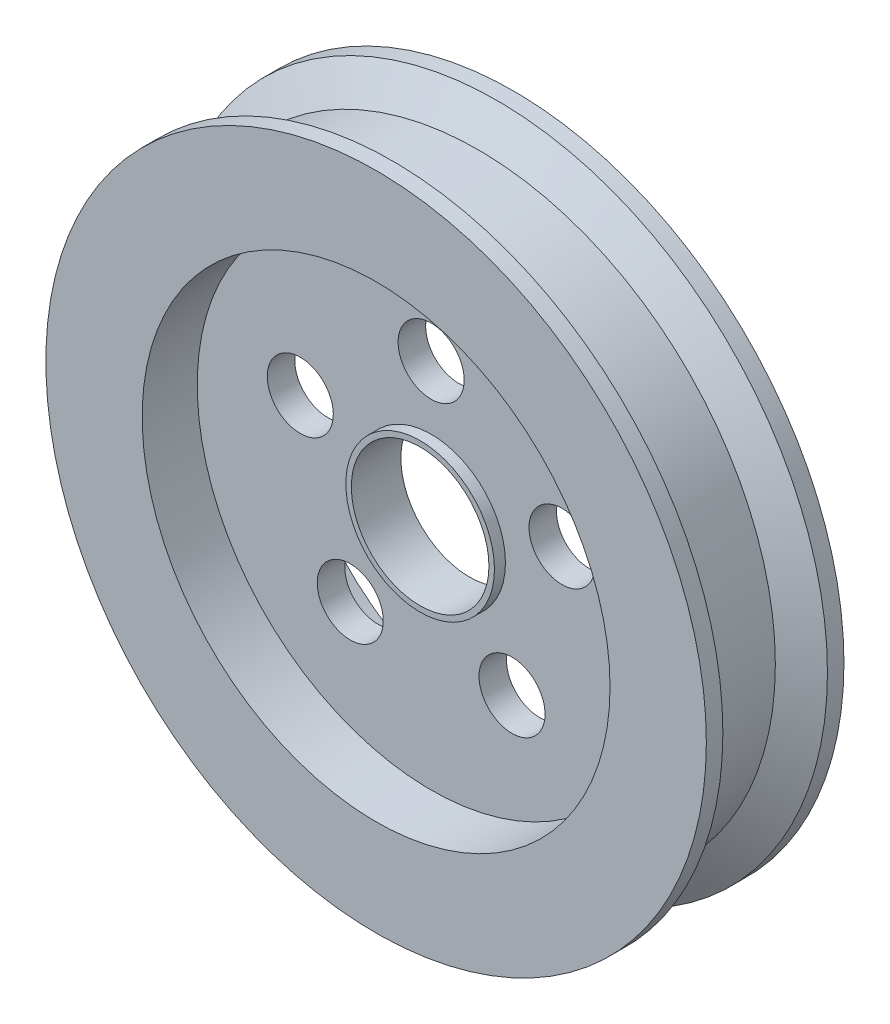
ISO-10303-21;
HEADER;
FILE_DESCRIPTION(('STEP AP214'),'2;1');
FILE_NAME('part.step','',(''),(''),'','','');
FILE_SCHEMA(('AUTOMOTIVE_DESIGN { 1 0 10303 214 1 1 1 1 }'));
ENDSEC;
DATA;
#1=APPLICATION_CONTEXT('core data for automotive mechanical design processes');
#2=APPLICATION_PROTOCOL_DEFINITION('international standard','automotive_design',2000,#1);
#3=PRODUCT_CONTEXT('',#1,'mechanical');
#4=PRODUCT('Part','Part','',(#3));
#5=PRODUCT_RELATED_PRODUCT_CATEGORY('part','',(#4));
#6=PRODUCT_DEFINITION_FORMATION('','',#4);
#7=PRODUCT_DEFINITION_CONTEXT('part definition',#1,'design');
#8=PRODUCT_DEFINITION('design','',#6,#7);
#9=PRODUCT_DEFINITION_SHAPE('','',#8);
#10=(LENGTH_UNIT() NAMED_UNIT(*) SI_UNIT(.MILLI.,.METRE.));
#11=(NAMED_UNIT(*) PLANE_ANGLE_UNIT() SI_UNIT($,.RADIAN.));
#12=(NAMED_UNIT(*) SI_UNIT($,.STERADIAN.) SOLID_ANGLE_UNIT());
#13=UNCERTAINTY_MEASURE_WITH_UNIT(LENGTH_MEASURE(1.E-05),#10,'distance_accuracy_value','');
#14=(GEOMETRIC_REPRESENTATION_CONTEXT(3) GLOBAL_UNCERTAINTY_ASSIGNED_CONTEXT((#13)) GLOBAL_UNIT_ASSIGNED_CONTEXT((#10,
#11,#12)) REPRESENTATION_CONTEXT('',''));
#15=CARTESIAN_POINT('',(0.,0.,0.));
#16=DIRECTION('',(0.,0.,1.));
#17=DIRECTION('',(1.,0.,0.));
#18=AXIS2_PLACEMENT_3D('',#15,#16,#17);
#19=CARTESIAN_POINT('',(0.,0.,12.5));
#20=DIRECTION('',(0.,0.,-1.));
#21=DIRECTION('',(-1.,0.,0.));
#22=AXIS2_PLACEMENT_3D('',#19,#20,#21);
#23=CYLINDRICAL_SURFACE('',#22,60.);
#24=CARTESIAN_POINT('',(0.,0.,-9.5));
#25=DIRECTION('',(0.,0.,1.));
#26=DIRECTION('',(1.,0.,0.));
#27=AXIS2_PLACEMENT_3D('',#24,#25,#26);
#28=CIRCLE('',#27,60.);
#29=CARTESIAN_POINT('',(60.,0.,-9.5));
#30=VERTEX_POINT('',#29);
#31=EDGE_CURVE('E57',#30,#30,#28,.T.);
#32=ORIENTED_EDGE('',*,*,#31,.F.);
#33=EDGE_LOOP('',(#32));
#34=FACE_BOUND('',#33,.T.);
#35=CARTESIAN_POINT('',(0.,0.,-12.5));
#36=DIRECTION('',(0.,0.,1.));
#37=DIRECTION('',(1.,0.,0.));
#38=AXIS2_PLACEMENT_3D('',#35,#36,#37);
#39=CIRCLE('',#38,60.);
#40=CARTESIAN_POINT('',(60.,0.,-12.5));
#41=VERTEX_POINT('',#40);
#42=EDGE_CURVE('E88',#41,#41,#39,.T.);
#43=ORIENTED_EDGE('',*,*,#42,.T.);
#44=EDGE_LOOP('',(#43));
#45=FACE_BOUND('',#44,.T.);
#46=ADVANCED_FACE('F31',(#34,#45),#23,.T.);
#47=CARTESIAN_POINT('',(0.,0.,12.5));
#48=DIRECTION('',(0.,0.,1.));
#49=DIRECTION('',(1.,0.,0.));
#50=AXIS2_PLACEMENT_3D('',#47,#48,#49);
#51=PLANE('',#50);
#52=CARTESIAN_POINT('',(0.,0.,12.5));
#53=DIRECTION('',(0.,0.,1.));
#54=DIRECTION('',(1.,0.,0.));
#55=AXIS2_PLACEMENT_3D('',#52,#53,#54);
#56=CIRCLE('',#55,42.5);
#57=CARTESIAN_POINT('',(42.5,0.,12.5));
#58=VERTEX_POINT('',#57);
#59=EDGE_CURVE('E81',#58,#58,#56,.T.);
#60=ORIENTED_EDGE('',*,*,#59,.F.);
#61=EDGE_LOOP('',(#60));
#62=FACE_BOUND('',#61,.T.);
#63=CARTESIAN_POINT('',(0.,0.,12.5));
#64=DIRECTION('',(0.,0.,1.));
#65=DIRECTION('',(1.,0.,0.));
#66=AXIS2_PLACEMENT_3D('',#63,#64,#65);
#67=CIRCLE('',#66,60.);
#68=CARTESIAN_POINT('',(60.,0.,12.5));
#69=VERTEX_POINT('',#68);
#70=EDGE_CURVE('E43',#69,#69,#67,.T.);
#71=ORIENTED_EDGE('',*,*,#70,.T.);
#72=EDGE_LOOP('',(#71));
#73=FACE_BOUND('',#72,.T.);
#74=ADVANCED_FACE('F136',(#62,#73),#51,.T.);
#75=CARTESIAN_POINT('',(0.,0.,-12.5));
#76=DIRECTION('',(0.,0.,1.));
#77=DIRECTION('',(1.,0.,0.));
#78=AXIS2_PLACEMENT_3D('',#75,#76,#77);
#79=PLANE('',#78);
#80=CARTESIAN_POINT('',(0.,0.,-12.5));
#81=DIRECTION('',(0.,0.,1.));
#82=DIRECTION('',(1.,0.,0.));
#83=AXIS2_PLACEMENT_3D('',#80,#81,#82);
#84=CIRCLE('',#83,42.5);
#85=CARTESIAN_POINT('',(42.5,0.,-12.5));
#86=VERTEX_POINT('',#85);
#87=EDGE_CURVE('E82',#86,#86,#84,.T.);
#88=ORIENTED_EDGE('',*,*,#87,.T.);
#89=EDGE_LOOP('',(#88));
#90=FACE_BOUND('',#89,.T.);
#91=ORIENTED_EDGE('',*,*,#42,.F.);
#92=EDGE_LOOP('',(#91));
#93=FACE_BOUND('',#92,.T.);
#94=ADVANCED_FACE('F133',(#90,#93),#79,.F.);
#95=CARTESIAN_POINT('',(0.,0.,9.5));
#96=DIRECTION('',(0.,0.,1.));
#97=DIRECTION('',(1.,0.,0.));
#98=AXIS2_PLACEMENT_3D('',#95,#96,#97);
#99=CIRCLE('',#98,60.);
#100=CARTESIAN_POINT('',(60.,0.,9.5));
#101=VERTEX_POINT('',#100);
#102=EDGE_CURVE('E48',#101,#101,#99,.T.);
#103=ORIENTED_EDGE('',*,*,#102,.T.);
#104=EDGE_LOOP('',(#103));
#105=FACE_BOUND('',#104,.T.);
#106=ORIENTED_EDGE('',*,*,#70,.F.);
#107=EDGE_LOOP('',(#106));
#108=FACE_BOUND('',#107,.T.);
#109=ADVANCED_FACE('F33',(#105,#108),#23,.T.);
#110=CARTESIAN_POINT('',(0.,0.,2.5));
#111=DIRECTION('',(0.,0.,1.));
#112=DIRECTION('',(1.,0.,0.));
#113=AXIS2_PLACEMENT_3D('',#110,#111,#112);
#114=CYLINDRICAL_SURFACE('',#113,42.5);
#115=CARTESIAN_POINT('',(0.,0.,2.5));
#116=DIRECTION('',(0.,0.,1.));
#117=DIRECTION('',(1.,0.,0.));
#118=AXIS2_PLACEMENT_3D('',#115,#116,#117);
#119=CIRCLE('',#118,42.5);
#120=CARTESIAN_POINT('',(42.5,0.,2.5));
#121=VERTEX_POINT('',#120);
#122=EDGE_CURVE('E85',#121,#121,#119,.T.);
#123=ORIENTED_EDGE('',*,*,#122,.F.);
#124=EDGE_LOOP('',(#123));
#125=FACE_BOUND('',#124,.T.);
#126=ORIENTED_EDGE('',*,*,#59,.T.);
#127=EDGE_LOOP('',(#126));
#128=FACE_BOUND('',#127,.T.);
#129=ADVANCED_FACE('F148',(#125,#128),#114,.F.);
#130=CARTESIAN_POINT('',(0.,0.,2.5));
#131=DIRECTION('',(0.,0.,1.));
#132=DIRECTION('',(1.,0.,0.));
#133=AXIS2_PLACEMENT_3D('',#130,#131,#132);
#134=PLANE('',#133);
#135=CARTESIAN_POINT('',(0.,0.,2.5));
#136=DIRECTION('',(0.,0.,1.));
#137=DIRECTION('',(1.,0.,0.));
#138=AXIS2_PLACEMENT_3D('',#135,#136,#137);
#139=CIRCLE('',#138,13.5);
#140=CARTESIAN_POINT('',(13.5,0.,2.5));
#141=VERTEX_POINT('',#140);
#142=EDGE_CURVE('E10',#141,#141,#139,.T.);
#143=ORIENTED_EDGE('',*,*,#142,.F.);
#144=EDGE_LOOP('',(#143));
#145=FACE_BOUND('',#144,.T.);
#146=CARTESIAN_POINT('',(-23.7764129073788,7.72542485937396,2.5));
#147=DIRECTION('',(0.,0.,1.));
#148=DIRECTION('',(0.309016994374958,0.95105651629515,0.));
#149=AXIS2_PLACEMENT_3D('',#146,#147,#148);
#150=CIRCLE('',#149,6.);
#151=CARTESIAN_POINT('',(-21.922310941129,13.4317639571449,2.5));
#152=VERTEX_POINT('',#151);
#153=EDGE_CURVE('E60',#152,#152,#150,.T.);
#154=ORIENTED_EDGE('',*,*,#153,.F.);
#155=EDGE_LOOP('',(#154));
#156=FACE_BOUND('',#155,.T.);
#157=CARTESIAN_POINT('',(-14.694631307312,-20.2254248593736,2.5));
#158=DIRECTION('',(0.,0.,1.));
#159=DIRECTION('',(-0.809016994374942,0.58778525229248,0.));
#160=AXIS2_PLACEMENT_3D('',#157,#158,#159);
#161=CIRCLE('',#160,6.);
#162=CARTESIAN_POINT('',(-19.5487332735617,-16.6987133456187,2.5));
#163=VERTEX_POINT('',#162);
#164=EDGE_CURVE('E65',#163,#163,#161,.T.);
#165=ORIENTED_EDGE('',*,*,#164,.F.);
#166=EDGE_LOOP('',(#165));
#167=FACE_BOUND('',#166,.T.);
#168=CARTESIAN_POINT('',(14.6946313073117,-20.2254248593738,2.5));
#169=DIRECTION('',(0.,0.,1.));
#170=DIRECTION('',(-0.809016994374951,-0.587785252292469,0.));
#171=AXIS2_PLACEMENT_3D('',#168,#169,#170);
#172=CIRCLE('',#171,6.);
#173=CARTESIAN_POINT('',(9.84052934106201,-23.7521363731286,2.5));
#174=VERTEX_POINT('',#173);
#175=EDGE_CURVE('E61',#174,#174,#172,.T.);
#176=ORIENTED_EDGE('',*,*,#175,.F.);
#177=EDGE_LOOP('',(#176));
#178=FACE_BOUND('',#177,.T.);
#179=CARTESIAN_POINT('',(23.7764129073789,7.72542485937362,2.5));
#180=DIRECTION('',(0.,0.,1.));
#181=DIRECTION('',(0.309016994374945,-0.951056516295155,0.));
#182=AXIS2_PLACEMENT_3D('',#179,#180,#181);
#183=CIRCLE('',#182,6.);
#184=CARTESIAN_POINT('',(25.6305148736285,2.01908576160269,2.5));
#185=VERTEX_POINT('',#184);
#186=EDGE_CURVE('E64',#185,#185,#183,.T.);
#187=ORIENTED_EDGE('',*,*,#186,.F.);
#188=EDGE_LOOP('',(#187));
#189=FACE_BOUND('',#188,.T.);
#190=CARTESIAN_POINT('',(0.,25.,2.5));
#191=DIRECTION('',(0.,0.,1.));
#192=DIRECTION('',(1.,0.,0.));
#193=AXIS2_PLACEMENT_3D('',#190,#191,#192);
#194=CIRCLE('',#193,6.);
#195=CARTESIAN_POINT('',(6.,25.,2.5));
#196=VERTEX_POINT('',#195);
#197=EDGE_CURVE('E73',#196,#196,#194,.T.);
#198=ORIENTED_EDGE('',*,*,#197,.F.);
#199=EDGE_LOOP('',(#198));
#200=FACE_BOUND('',#199,.T.);
#201=ORIENTED_EDGE('',*,*,#122,.T.);
#202=EDGE_LOOP('',(#201));
#203=FACE_BOUND('',#202,.T.);
#204=ADVANCED_FACE('F129',(#145,#156,#167,#178,#189,#200,#203),#134,.T.);
#205=CARTESIAN_POINT('',(0.,0.,-2.5));
#206=DIRECTION('',(0.,0.,-1.));
#207=DIRECTION('',(-1.,0.,0.));
#208=AXIS2_PLACEMENT_3D('',#205,#206,#207);
#209=CYLINDRICAL_SURFACE('',#208,42.5);
#210=CARTESIAN_POINT('',(0.,0.,-2.5));
#211=DIRECTION('',(0.,0.,1.));
#212=DIRECTION('',(1.,0.,0.));
#213=AXIS2_PLACEMENT_3D('',#210,#211,#212);
#214=CIRCLE('',#213,42.5);
#215=CARTESIAN_POINT('',(42.5,0.,-2.5));
#216=VERTEX_POINT('',#215);
#217=EDGE_CURVE('E78',#216,#216,#214,.T.);
#218=ORIENTED_EDGE('',*,*,#217,.T.);
#219=EDGE_LOOP('',(#218));
#220=FACE_BOUND('',#219,.T.);
#221=ORIENTED_EDGE('',*,*,#87,.F.);
#222=EDGE_LOOP('',(#221));
#223=FACE_BOUND('',#222,.T.);
#224=ADVANCED_FACE('F114',(#220,#223),#209,.F.);
#225=CARTESIAN_POINT('',(0.,0.,-2.5));
#226=DIRECTION('',(0.,0.,-1.));
#227=DIRECTION('',(1.,0.,0.));
#228=AXIS2_PLACEMENT_3D('',#225,#226,#227);
#229=PLANE('',#228);
#230=CARTESIAN_POINT('',(0.,0.,-2.5));
#231=DIRECTION('',(0.,0.,-1.));
#232=DIRECTION('',(-1.,0.,0.));
#233=AXIS2_PLACEMENT_3D('',#230,#231,#232);
#234=CIRCLE('',#233,13.5);
#235=CARTESIAN_POINT('',(-13.5,0.,-2.5));
#236=VERTEX_POINT('',#235);
#237=EDGE_CURVE('E35',#236,#236,#234,.T.);
#238=ORIENTED_EDGE('',*,*,#237,.F.);
#239=EDGE_LOOP('',(#238));
#240=FACE_BOUND('',#239,.T.);
#241=CARTESIAN_POINT('',(-23.7764129073788,7.72542485937396,-2.5));
#242=DIRECTION('',(0.,0.,-1.));
#243=DIRECTION('',(-1.,0.,0.));
#244=AXIS2_PLACEMENT_3D('',#241,#242,#243);
#245=CIRCLE('',#244,6.);
#246=CARTESIAN_POINT('',(-29.7764129073788,7.72542485937396,-2.5));
#247=VERTEX_POINT('',#246);
#248=EDGE_CURVE('E77',#247,#247,#245,.T.);
#249=ORIENTED_EDGE('',*,*,#248,.F.);
#250=EDGE_LOOP('',(#249));
#251=FACE_BOUND('',#250,.T.);
#252=CARTESIAN_POINT('',(-14.694631307312,-20.2254248593736,-2.5));
#253=DIRECTION('',(0.,0.,-1.));
#254=DIRECTION('',(-1.,0.,0.));
#255=AXIS2_PLACEMENT_3D('',#252,#253,#254);
#256=CIRCLE('',#255,6.);
#257=CARTESIAN_POINT('',(-20.694631307312,-20.2254248593736,-2.5));
#258=VERTEX_POINT('',#257);
#259=EDGE_CURVE('E102',#258,#258,#256,.T.);
#260=ORIENTED_EDGE('',*,*,#259,.F.);
#261=EDGE_LOOP('',(#260));
#262=FACE_BOUND('',#261,.T.);
#263=CARTESIAN_POINT('',(14.6946313073117,-20.2254248593738,-2.5));
#264=DIRECTION('',(0.,0.,-1.));
#265=DIRECTION('',(-1.,0.,0.));
#266=AXIS2_PLACEMENT_3D('',#263,#264,#265);
#267=CIRCLE('',#266,6.);
#268=CARTESIAN_POINT('',(8.69463130731171,-20.2254248593738,-2.5));
#269=VERTEX_POINT('',#268);
#270=EDGE_CURVE('E99',#269,#269,#267,.T.);
#271=ORIENTED_EDGE('',*,*,#270,.F.);
#272=EDGE_LOOP('',(#271));
#273=FACE_BOUND('',#272,.T.);
#274=CARTESIAN_POINT('',(23.7764129073789,7.72542485937362,-2.5));
#275=DIRECTION('',(0.,0.,-1.));
#276=DIRECTION('',(-1.,0.,0.));
#277=AXIS2_PLACEMENT_3D('',#274,#275,#276);
#278=CIRCLE('',#277,6.);
#279=CARTESIAN_POINT('',(17.7764129073789,7.72542485937362,-2.5));
#280=VERTEX_POINT('',#279);
#281=EDGE_CURVE('E72',#280,#280,#278,.T.);
#282=ORIENTED_EDGE('',*,*,#281,.F.);
#283=EDGE_LOOP('',(#282));
#284=FACE_BOUND('',#283,.T.);
#285=CARTESIAN_POINT('',(0.,25.,-2.5));
#286=DIRECTION('',(0.,0.,-1.));
#287=DIRECTION('',(-1.,0.,0.));
#288=AXIS2_PLACEMENT_3D('',#285,#286,#287);
#289=CIRCLE('',#288,6.);
#290=CARTESIAN_POINT('',(-6.,25.,-2.5));
#291=VERTEX_POINT('',#290);
#292=EDGE_CURVE('E76',#291,#291,#289,.T.);
#293=ORIENTED_EDGE('',*,*,#292,.F.);
#294=EDGE_LOOP('',(#293));
#295=FACE_BOUND('',#294,.T.);
#296=ORIENTED_EDGE('',*,*,#217,.F.);
#297=EDGE_LOOP('',(#296));
#298=FACE_BOUND('',#297,.T.);
#299=ADVANCED_FACE('F110',(#240,#251,#262,#273,#284,#295,#298),#229,.T.);
#300=CARTESIAN_POINT('',(0.,25.,-12.5));
#301=DIRECTION('',(0.,0.,1.));
#302=DIRECTION('',(1.,0.,0.));
#303=AXIS2_PLACEMENT_3D('',#300,#301,#302);
#304=CYLINDRICAL_SURFACE('',#303,6.);
#305=ORIENTED_EDGE('',*,*,#292,.T.);
#306=EDGE_LOOP('',(#305));
#307=FACE_BOUND('',#306,.T.);
#308=ORIENTED_EDGE('',*,*,#197,.T.);
#309=EDGE_LOOP('',(#308));
#310=FACE_BOUND('',#309,.T.);
#311=ADVANCED_FACE('F113',(#307,#310),#304,.F.);
#312=CARTESIAN_POINT('',(23.7764129073789,7.72542485937362,-12.5));
#313=DIRECTION('',(0.,0.,1.));
#314=DIRECTION('',(1.,0.,0.));
#315=AXIS2_PLACEMENT_3D('',#312,#313,#314);
#316=CYLINDRICAL_SURFACE('',#315,6.);
#317=ORIENTED_EDGE('',*,*,#281,.T.);
#318=EDGE_LOOP('',(#317));
#319=FACE_BOUND('',#318,.T.);
#320=ORIENTED_EDGE('',*,*,#186,.T.);
#321=EDGE_LOOP('',(#320));
#322=FACE_BOUND('',#321,.T.);
#323=ADVANCED_FACE('F186',(#319,#322),#316,.F.);
#324=CARTESIAN_POINT('',(14.6946313073117,-20.2254248593738,-12.5));
#325=DIRECTION('',(0.,0.,1.));
#326=DIRECTION('',(1.,0.,0.));
#327=AXIS2_PLACEMENT_3D('',#324,#325,#326);
#328=CYLINDRICAL_SURFACE('',#327,6.);
#329=ORIENTED_EDGE('',*,*,#270,.T.);
#330=EDGE_LOOP('',(#329));
#331=FACE_BOUND('',#330,.T.);
#332=ORIENTED_EDGE('',*,*,#175,.T.);
#333=EDGE_LOOP('',(#332));
#334=FACE_BOUND('',#333,.T.);
#335=ADVANCED_FACE('F183',(#331,#334),#328,.F.);
#336=CARTESIAN_POINT('',(-14.694631307312,-20.2254248593736,-12.5));
#337=DIRECTION('',(0.,0.,1.));
#338=DIRECTION('',(1.,0.,0.));
#339=AXIS2_PLACEMENT_3D('',#336,#337,#338);
#340=CYLINDRICAL_SURFACE('',#339,6.);
#341=ORIENTED_EDGE('',*,*,#259,.T.);
#342=EDGE_LOOP('',(#341));
#343=FACE_BOUND('',#342,.T.);
#344=ORIENTED_EDGE('',*,*,#164,.T.);
#345=EDGE_LOOP('',(#344));
#346=FACE_BOUND('',#345,.T.);
#347=ADVANCED_FACE('F180',(#343,#346),#340,.F.);
#348=CARTESIAN_POINT('',(-23.7764129073788,7.72542485937396,-12.5));
#349=DIRECTION('',(0.,0.,1.));
#350=DIRECTION('',(1.,0.,0.));
#351=AXIS2_PLACEMENT_3D('',#348,#349,#350);
#352=CYLINDRICAL_SURFACE('',#351,6.);
#353=ORIENTED_EDGE('',*,*,#248,.T.);
#354=EDGE_LOOP('',(#353));
#355=FACE_BOUND('',#354,.T.);
#356=ORIENTED_EDGE('',*,*,#153,.T.);
#357=EDGE_LOOP('',(#356));
#358=FACE_BOUND('',#357,.T.);
#359=ADVANCED_FACE('F107',(#355,#358),#352,.F.);
#360=CARTESIAN_POINT('',(0.,0.,-9.5));
#361=DIRECTION('',(0.,0.,-1.));
#362=DIRECTION('',(-1.,0.,0.));
#363=AXIS2_PLACEMENT_3D('',#360,#361,#362);
#364=CONICAL_SURFACE('',#363,60.,1.04719755119659);
#365=CARTESIAN_POINT('',(0.,0.,-6.03589838486221));
#366=DIRECTION('',(0.,0.,1.));
#367=DIRECTION('',(1.,0.,0.));
#368=AXIS2_PLACEMENT_3D('',#365,#366,#367);
#369=CIRCLE('',#368,54.);
#370=CARTESIAN_POINT('',(54.,0.,-6.03589838486221));
#371=VERTEX_POINT('',#370);
#372=EDGE_CURVE('E54',#371,#371,#369,.T.);
#373=ORIENTED_EDGE('',*,*,#372,.F.);
#374=EDGE_LOOP('',(#373));
#375=FACE_BOUND('',#374,.T.);
#376=ORIENTED_EDGE('',*,*,#31,.T.);
#377=EDGE_LOOP('',(#376));
#378=FACE_BOUND('',#377,.T.);
#379=ADVANCED_FACE('F170',(#375,#378),#364,.T.);
#380=CARTESIAN_POINT('',(0.,0.,0.));
#381=DIRECTION('',(0.,0.,1.));
#382=DIRECTION('',(1.,0.,0.));
#383=AXIS2_PLACEMENT_3D('',#380,#381,#382);
#384=CYLINDRICAL_SURFACE('',#383,54.);
#385=CARTESIAN_POINT('',(0.,0.,6.03589838486221));
#386=DIRECTION('',(0.,0.,1.));
#387=DIRECTION('',(1.,0.,0.));
#388=AXIS2_PLACEMENT_3D('',#385,#386,#387);
#389=CIRCLE('',#388,54.);
#390=CARTESIAN_POINT('',(54.,0.,6.03589838486221));
#391=VERTEX_POINT('',#390);
#392=EDGE_CURVE('E51',#391,#391,#389,.T.);
#393=ORIENTED_EDGE('',*,*,#392,.F.);
#394=EDGE_LOOP('',(#393));
#395=FACE_BOUND('',#394,.T.);
#396=ORIENTED_EDGE('',*,*,#372,.T.);
#397=EDGE_LOOP('',(#396));
#398=FACE_BOUND('',#397,.T.);
#399=ADVANCED_FACE('F164',(#395,#398),#384,.T.);
#400=CARTESIAN_POINT('',(0.,0.,6.03589838486221));
#401=DIRECTION('',(0.,0.,1.));
#402=DIRECTION('',(1.,0.,0.));
#403=AXIS2_PLACEMENT_3D('',#400,#401,#402);
#404=CONICAL_SURFACE('',#403,54.,1.04719755119659);
#405=ORIENTED_EDGE('',*,*,#102,.F.);
#406=EDGE_LOOP('',(#405));
#407=FACE_BOUND('',#406,.T.);
#408=ORIENTED_EDGE('',*,*,#392,.T.);
#409=EDGE_LOOP('',(#408));
#410=FACE_BOUND('',#409,.T.);
#411=ADVANCED_FACE('F160',(#407,#410),#404,.T.);
#412=CARTESIAN_POINT('',(0.,0.,-4.5));
#413=DIRECTION('',(0.,0.,1.));
#414=DIRECTION('',(1.,0.,0.));
#415=AXIS2_PLACEMENT_3D('',#412,#413,#414);
#416=CYLINDRICAL_SURFACE('',#415,13.5);
#417=ORIENTED_EDGE('',*,*,#237,.T.);
#418=EDGE_LOOP('',(#417));
#419=FACE_BOUND('',#418,.T.);
#420=CARTESIAN_POINT('',(0.,0.,-4.5));
#421=DIRECTION('',(0.,0.,1.));
#422=DIRECTION('',(1.,0.,0.));
#423=AXIS2_PLACEMENT_3D('',#420,#421,#422);
#424=CIRCLE('',#423,13.5);
#425=CARTESIAN_POINT('',(13.5,0.,-4.5));
#426=VERTEX_POINT('',#425);
#427=EDGE_CURVE('E46',#426,#426,#424,.T.);
#428=ORIENTED_EDGE('',*,*,#427,.T.);
#429=EDGE_LOOP('',(#428));
#430=FACE_BOUND('',#429,.T.);
#431=ADVANCED_FACE('F163',(#419,#430),#416,.T.);
#432=CARTESIAN_POINT('',(0.,0.,-4.5));
#433=DIRECTION('',(0.,0.,1.));
#434=DIRECTION('',(1.,0.,0.));
#435=AXIS2_PLACEMENT_3D('',#432,#433,#434);
#436=PLANE('',#435);
#437=CARTESIAN_POINT('',(0.,0.,-4.5));
#438=DIRECTION('',(0.,0.,1.));
#439=DIRECTION('',(1.,0.,0.));
#440=AXIS2_PLACEMENT_3D('',#437,#438,#439);
#441=CIRCLE('',#440,12.5);
#442=CARTESIAN_POINT('',(12.5,0.,-4.5));
#443=VERTEX_POINT('',#442);
#444=EDGE_CURVE('E213',#443,#443,#441,.T.);
#445=ORIENTED_EDGE('',*,*,#444,.T.);
#446=EDGE_LOOP('',(#445));
#447=FACE_BOUND('',#446,.T.);
#448=ORIENTED_EDGE('',*,*,#427,.F.);
#449=EDGE_LOOP('',(#448));
#450=FACE_BOUND('',#449,.T.);
#451=ADVANCED_FACE('F227',(#447,#450),#436,.F.);
#452=ORIENTED_EDGE('',*,*,#142,.T.);
#453=EDGE_LOOP('',(#452));
#454=FACE_BOUND('',#453,.T.);
#455=CARTESIAN_POINT('',(0.,0.,4.5));
#456=DIRECTION('',(0.,0.,1.));
#457=DIRECTION('',(1.,0.,0.));
#458=AXIS2_PLACEMENT_3D('',#455,#456,#457);
#459=CIRCLE('',#458,13.5);
#460=CARTESIAN_POINT('',(13.5,0.,4.5));
#461=VERTEX_POINT('',#460);
#462=EDGE_CURVE('E218',#461,#461,#459,.T.);
#463=ORIENTED_EDGE('',*,*,#462,.F.);
#464=EDGE_LOOP('',(#463));
#465=FACE_BOUND('',#464,.T.);
#466=ADVANCED_FACE('F207',(#454,#465),#416,.T.);
#467=CARTESIAN_POINT('',(0.,0.,4.5));
#468=DIRECTION('',(0.,0.,1.));
#469=DIRECTION('',(1.,0.,0.));
#470=AXIS2_PLACEMENT_3D('',#467,#468,#469);
#471=PLANE('',#470);
#472=ORIENTED_EDGE('',*,*,#462,.T.);
#473=EDGE_LOOP('',(#472));
#474=FACE_BOUND('',#473,.T.);
#475=CARTESIAN_POINT('',(0.,0.,4.5));
#476=DIRECTION('',(0.,0.,1.));
#477=DIRECTION('',(1.,0.,0.));
#478=AXIS2_PLACEMENT_3D('',#475,#476,#477);
#479=CIRCLE('',#478,12.5);
#480=CARTESIAN_POINT('',(12.5,0.,4.5));
#481=VERTEX_POINT('',#480);
#482=EDGE_CURVE('E216',#481,#481,#479,.T.);
#483=ORIENTED_EDGE('',*,*,#482,.F.);
#484=EDGE_LOOP('',(#483));
#485=FACE_BOUND('',#484,.T.);
#486=ADVANCED_FACE('F202',(#474,#485),#471,.T.);
#487=CARTESIAN_POINT('',(0.,0.,12.5));
#488=DIRECTION('',(0.,0.,-1.));
#489=DIRECTION('',(-1.,0.,0.));
#490=AXIS2_PLACEMENT_3D('',#487,#488,#489);
#491=CYLINDRICAL_SURFACE('',#490,12.5);
#492=ORIENTED_EDGE('',*,*,#444,.F.);
#493=EDGE_LOOP('',(#492));
#494=FACE_BOUND('',#493,.T.);
#495=ORIENTED_EDGE('',*,*,#482,.T.);
#496=EDGE_LOOP('',(#495));
#497=FACE_BOUND('',#496,.T.);
#498=ADVANCED_FACE('F200',(#494,#497),#491,.F.);
#499=CLOSED_SHELL('',(#46,#74,#94,#109,#129,#204,#224,#299,#311,#323,#335,#347,#359,#379,#399,
#411,#431,#451,#466,#486,#498));
#500=MANIFOLD_SOLID_BREP('B2',#499);
#501=ADVANCED_BREP_SHAPE_REPRESENTATION('',(#18,#500),#14);
#502=SHAPE_DEFINITION_REPRESENTATION(#9,#501);
ENDSEC;
END-ISO-10303-21;
